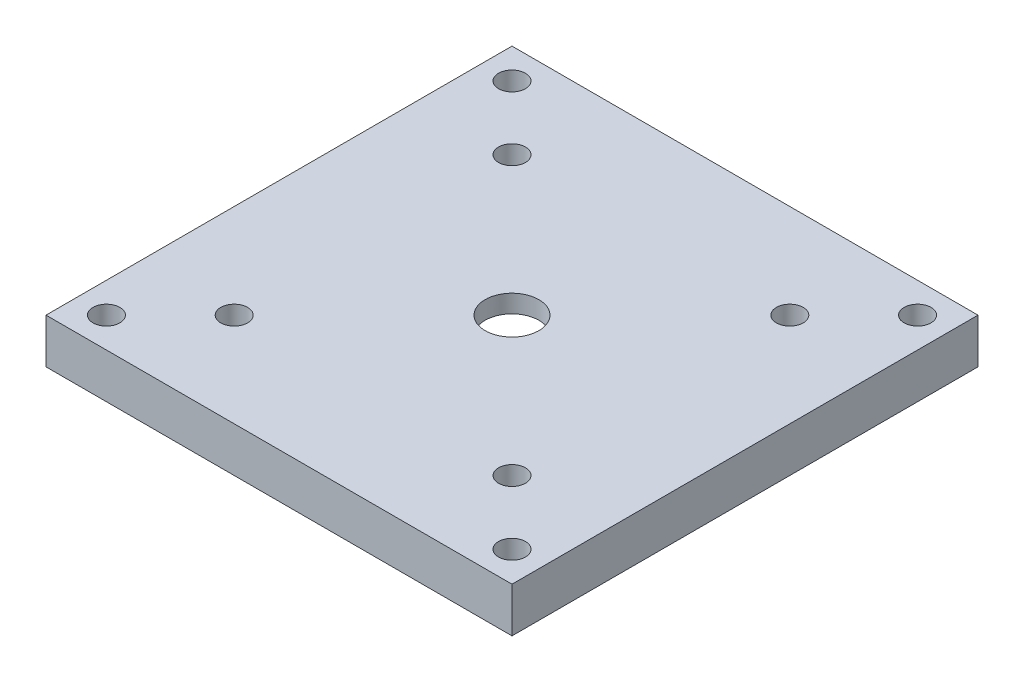
ISO-10303-21;
HEADER;
FILE_DESCRIPTION(('STEP AP214'),'2;1');
FILE_NAME('part.step','',(''),(''),'','','');
FILE_SCHEMA(('AUTOMOTIVE_DESIGN { 1 0 10303 214 1 1 1 1 }'));
ENDSEC;
DATA;
#1=APPLICATION_CONTEXT('core data for automotive mechanical design processes');
#2=APPLICATION_PROTOCOL_DEFINITION('international standard','automotive_design',2000,#1);
#3=PRODUCT_CONTEXT('',#1,'mechanical');
#4=PRODUCT('Part','Part','',(#3));
#5=PRODUCT_RELATED_PRODUCT_CATEGORY('part','',(#4));
#6=PRODUCT_DEFINITION_FORMATION('','',#4);
#7=PRODUCT_DEFINITION_CONTEXT('part definition',#1,'design');
#8=PRODUCT_DEFINITION('design','',#6,#7);
#9=PRODUCT_DEFINITION_SHAPE('','',#8);
#10=(LENGTH_UNIT() NAMED_UNIT(*) SI_UNIT(.MILLI.,.METRE.));
#11=(NAMED_UNIT(*) PLANE_ANGLE_UNIT() SI_UNIT($,.RADIAN.));
#12=(NAMED_UNIT(*) SI_UNIT($,.STERADIAN.) SOLID_ANGLE_UNIT());
#13=UNCERTAINTY_MEASURE_WITH_UNIT(LENGTH_MEASURE(1.E-05),#10,'distance_accuracy_value','');
#14=(GEOMETRIC_REPRESENTATION_CONTEXT(3) GLOBAL_UNCERTAINTY_ASSIGNED_CONTEXT((#13)) GLOBAL_UNIT_ASSIGNED_CONTEXT((#10,
#11,#12)) REPRESENTATION_CONTEXT('',''));
#15=CARTESIAN_POINT('',(0.,0.,0.));
#16=DIRECTION('',(0.,0.,1.));
#17=DIRECTION('',(1.,0.,0.));
#18=AXIS2_PLACEMENT_3D('',#15,#16,#17);
#19=CARTESIAN_POINT('',(0.,5.,0.));
#20=DIRECTION('',(0.,-1.,0.));
#21=DIRECTION('',(0.,0.,-1.));
#22=AXIS2_PLACEMENT_3D('',#19,#20,#21);
#23=PLANE('',#22);
#24=CARTESIAN_POINT('',(15.5,5.,-15.5));
#25=DIRECTION('',(0.,-1.,0.));
#26=DIRECTION('',(0.,0.,-1.));
#27=AXIS2_PLACEMENT_3D('',#24,#25,#26);
#28=CIRCLE('',#27,1.5);
#29=CARTESIAN_POINT('',(15.5,5.,-17.));
#30=VERTEX_POINT('',#29);
#31=EDGE_CURVE('E234',#30,#30,#28,.F.);
#32=ORIENTED_EDGE('',*,*,#31,.F.);
#33=EDGE_LOOP('',(#32));
#34=FACE_BOUND('',#33,.T.);
#35=CARTESIAN_POINT('',(-15.5,5.,15.5));
#36=DIRECTION('',(0.,-1.,0.));
#37=DIRECTION('',(0.,0.,-1.));
#38=AXIS2_PLACEMENT_3D('',#35,#36,#37);
#39=CIRCLE('',#38,1.49999999999999);
#40=CARTESIAN_POINT('',(-15.5,5.,14.));
#41=VERTEX_POINT('',#40);
#42=EDGE_CURVE('E235',#41,#41,#39,.F.);
#43=ORIENTED_EDGE('',*,*,#42,.F.);
#44=EDGE_LOOP('',(#43));
#45=FACE_BOUND('',#44,.T.);
#46=CARTESIAN_POINT('',(0.,5.,0.));
#47=DIRECTION('',(0.,-1.,0.));
#48=DIRECTION('',(0.,0.,-1.));
#49=AXIS2_PLACEMENT_3D('',#46,#47,#48);
#50=CIRCLE('',#49,3.);
#51=CARTESIAN_POINT('',(0.,5.,-3.));
#52=VERTEX_POINT('',#51);
#53=EDGE_CURVE('E238',#52,#52,#50,.F.);
#54=ORIENTED_EDGE('',*,*,#53,.F.);
#55=EDGE_LOOP('',(#54));
#56=FACE_BOUND('',#55,.T.);
#57=CARTESIAN_POINT('',(-15.5,5.,-15.5));
#58=DIRECTION('',(0.,-1.,0.));
#59=DIRECTION('',(0.,0.,-1.));
#60=AXIS2_PLACEMENT_3D('',#57,#58,#59);
#61=CIRCLE('',#60,1.49999999999999);
#62=CARTESIAN_POINT('',(-15.5,5.,-17.));
#63=VERTEX_POINT('',#62);
#64=EDGE_CURVE('E108',#63,#63,#61,.T.);
#65=ORIENTED_EDGE('',*,*,#64,.T.);
#66=EDGE_LOOP('',(#65));
#67=FACE_BOUND('',#66,.T.);
#68=CARTESIAN_POINT('',(-22.6274169979695,5.,-22.6274169979695));
#69=DIRECTION('',(0.,-1.,0.));
#70=DIRECTION('',(0.,0.,-1.));
#71=AXIS2_PLACEMENT_3D('',#68,#69,#70);
#72=CIRCLE('',#71,1.5);
#73=CARTESIAN_POINT('',(-22.6274169979695,5.,-24.1274169979695));
#74=VERTEX_POINT('',#73);
#75=EDGE_CURVE('E149',#74,#74,#72,.T.);
#76=ORIENTED_EDGE('',*,*,#75,.T.);
#77=EDGE_LOOP('',(#76));
#78=FACE_BOUND('',#77,.T.);
#79=CARTESIAN_POINT('',(22.6274169979695,5.,22.6274169979695));
#80=DIRECTION('',(0.,-1.,0.));
#81=DIRECTION('',(0.,0.,-1.));
#82=AXIS2_PLACEMENT_3D('',#79,#80,#81);
#83=CIRCLE('',#82,1.5);
#84=CARTESIAN_POINT('',(22.6274169979695,5.,21.1274169979695));
#85=VERTEX_POINT('',#84);
#86=EDGE_CURVE('E143',#85,#85,#83,.T.);
#87=ORIENTED_EDGE('',*,*,#86,.T.);
#88=EDGE_LOOP('',(#87));
#89=FACE_BOUND('',#88,.T.);
#90=CARTESIAN_POINT('',(15.5,5.,15.5));
#91=DIRECTION('',(0.,-1.,0.));
#92=DIRECTION('',(0.,0.,-1.));
#93=AXIS2_PLACEMENT_3D('',#90,#91,#92);
#94=CIRCLE('',#93,1.5);
#95=CARTESIAN_POINT('',(15.5,5.,14.));
#96=VERTEX_POINT('',#95);
#97=EDGE_CURVE('E140',#96,#96,#94,.T.);
#98=ORIENTED_EDGE('',*,*,#97,.T.);
#99=EDGE_LOOP('',(#98));
#100=FACE_BOUND('',#99,.T.);
#101=DIRECTION('',(0.,0.,1.));
#102=VECTOR('',#101,1.);
#103=CARTESIAN_POINT('',(26.,5.,-26.));
#104=LINE('',#103,#102);
#105=CARTESIAN_POINT('',(26.,5.,-26.));
#106=VERTEX_POINT('',#105);
#107=CARTESIAN_POINT('',(26.,5.,26.));
#108=VERTEX_POINT('',#107);
#109=EDGE_CURVE('E98',#106,#108,#104,.T.);
#110=ORIENTED_EDGE('',*,*,#109,.F.);
#111=DIRECTION('',(-1.,0.,0.));
#112=VECTOR('',#111,1.);
#113=CARTESIAN_POINT('',(26.,5.,-26.));
#114=LINE('',#113,#112);
#115=CARTESIAN_POINT('',(-26.,5.,-26.));
#116=VERTEX_POINT('',#115);
#117=EDGE_CURVE('E87',#106,#116,#114,.T.);
#118=ORIENTED_EDGE('',*,*,#117,.T.);
#119=DIRECTION('',(0.,0.,1.));
#120=VECTOR('',#119,1.);
#121=CARTESIAN_POINT('',(-26.,5.,-26.));
#122=LINE('',#121,#120);
#123=CARTESIAN_POINT('',(-26.,5.,26.));
#124=VERTEX_POINT('',#123);
#125=EDGE_CURVE('E82',#116,#124,#122,.T.);
#126=ORIENTED_EDGE('',*,*,#125,.T.);
#127=DIRECTION('',(-1.,0.,0.));
#128=VECTOR('',#127,1.);
#129=CARTESIAN_POINT('',(26.,5.,26.));
#130=LINE('',#129,#128);
#131=EDGE_CURVE('E86',#108,#124,#130,.T.);
#132=ORIENTED_EDGE('',*,*,#131,.F.);
#133=EDGE_LOOP('',(#110,#118,#126,#132));
#134=FACE_BOUND('',#133,.T.);
#135=CARTESIAN_POINT('',(22.6274169979695,5.,-22.6274169979695));
#136=DIRECTION('',(0.,-1.,0.));
#137=DIRECTION('',(0.,0.,-1.));
#138=AXIS2_PLACEMENT_3D('',#135,#136,#137);
#139=CIRCLE('',#138,1.5);
#140=CARTESIAN_POINT('',(22.6274169979695,5.,-24.1274169979695));
#141=VERTEX_POINT('',#140);
#142=EDGE_CURVE('E146',#141,#141,#139,.F.);
#143=ORIENTED_EDGE('',*,*,#142,.F.);
#144=EDGE_LOOP('',(#143));
#145=FACE_BOUND('',#144,.T.);
#146=CARTESIAN_POINT('',(-22.6274169979695,5.,22.6274169979695));
#147=DIRECTION('',(0.,-1.,0.));
#148=DIRECTION('',(0.,0.,-1.));
#149=AXIS2_PLACEMENT_3D('',#146,#147,#148);
#150=CIRCLE('',#149,1.5);
#151=CARTESIAN_POINT('',(-22.6274169979695,5.,21.1274169979695));
#152=VERTEX_POINT('',#151);
#153=EDGE_CURVE('E152',#152,#152,#150,.F.);
#154=ORIENTED_EDGE('',*,*,#153,.F.);
#155=EDGE_LOOP('',(#154));
#156=FACE_BOUND('',#155,.T.);
#157=ADVANCED_FACE('F35',(#34,#45,#56,#67,#78,#89,#100,#134,#145,#156),#23,.F.);
#158=CARTESIAN_POINT('',(0.,0.,0.));
#159=DIRECTION('',(0.,-1.,0.));
#160=DIRECTION('',(0.,0.,-1.));
#161=AXIS2_PLACEMENT_3D('',#158,#159,#160);
#162=PLANE('',#161);
#163=CARTESIAN_POINT('',(15.5,0.,-15.5));
#164=DIRECTION('',(0.,1.,0.));
#165=DIRECTION('',(0.,0.,1.));
#166=AXIS2_PLACEMENT_3D('',#163,#164,#165);
#167=CIRCLE('',#166,1.5);
#168=CARTESIAN_POINT('',(15.5,0.,-14.));
#169=VERTEX_POINT('',#168);
#170=EDGE_CURVE('E232',#169,#169,#167,.T.);
#171=ORIENTED_EDGE('',*,*,#170,.T.);
#172=EDGE_LOOP('',(#171));
#173=FACE_BOUND('',#172,.T.);
#174=CARTESIAN_POINT('',(-15.5,0.,15.5));
#175=DIRECTION('',(0.,1.,0.));
#176=DIRECTION('',(0.,0.,1.));
#177=AXIS2_PLACEMENT_3D('',#174,#175,#176);
#178=CIRCLE('',#177,1.49999999999999);
#179=CARTESIAN_POINT('',(-15.5,0.,17.));
#180=VERTEX_POINT('',#179);
#181=EDGE_CURVE('E269',#180,#180,#178,.T.);
#182=ORIENTED_EDGE('',*,*,#181,.T.);
#183=EDGE_LOOP('',(#182));
#184=FACE_BOUND('',#183,.T.);
#185=CARTESIAN_POINT('',(0.,0.,0.));
#186=DIRECTION('',(0.,1.,0.));
#187=DIRECTION('',(0.,0.,1.));
#188=AXIS2_PLACEMENT_3D('',#185,#186,#187);
#189=CIRCLE('',#188,10.);
#190=CARTESIAN_POINT('',(0.,0.,10.));
#191=VERTEX_POINT('',#190);
#192=EDGE_CURVE('E245',#191,#191,#189,.T.);
#193=ORIENTED_EDGE('',*,*,#192,.T.);
#194=EDGE_LOOP('',(#193));
#195=FACE_BOUND('',#194,.T.);
#196=CARTESIAN_POINT('',(-15.5,0.,-15.5));
#197=DIRECTION('',(0.,-1.,0.));
#198=DIRECTION('',(0.,0.,-1.));
#199=AXIS2_PLACEMENT_3D('',#196,#197,#198);
#200=CIRCLE('',#199,1.49999999999999);
#201=CARTESIAN_POINT('',(-15.5,0.,-17.));
#202=VERTEX_POINT('',#201);
#203=EDGE_CURVE('E126',#202,#202,#200,.T.);
#204=ORIENTED_EDGE('',*,*,#203,.F.);
#205=EDGE_LOOP('',(#204));
#206=FACE_BOUND('',#205,.T.);
#207=CARTESIAN_POINT('',(22.6274169979695,0.,-22.6274169979695));
#208=DIRECTION('',(0.,1.,0.));
#209=DIRECTION('',(0.,0.,1.));
#210=AXIS2_PLACEMENT_3D('',#207,#208,#209);
#211=CIRCLE('',#210,1.5);
#212=CARTESIAN_POINT('',(22.6274169979695,0.,-21.1274169979695));
#213=VERTEX_POINT('',#212);
#214=EDGE_CURVE('E131',#213,#213,#211,.T.);
#215=ORIENTED_EDGE('',*,*,#214,.T.);
#216=EDGE_LOOP('',(#215));
#217=FACE_BOUND('',#216,.T.);
#218=CARTESIAN_POINT('',(22.6274169979695,0.,22.6274169979695));
#219=DIRECTION('',(0.,-1.,0.));
#220=DIRECTION('',(0.,0.,-1.));
#221=AXIS2_PLACEMENT_3D('',#218,#219,#220);
#222=CIRCLE('',#221,1.5);
#223=CARTESIAN_POINT('',(22.6274169979695,0.,21.1274169979695));
#224=VERTEX_POINT('',#223);
#225=EDGE_CURVE('E137',#224,#224,#222,.T.);
#226=ORIENTED_EDGE('',*,*,#225,.F.);
#227=EDGE_LOOP('',(#226));
#228=FACE_BOUND('',#227,.T.);
#229=CARTESIAN_POINT('',(15.5,0.,15.5));
#230=DIRECTION('',(0.,-1.,0.));
#231=DIRECTION('',(0.,0.,-1.));
#232=AXIS2_PLACEMENT_3D('',#229,#230,#231);
#233=CIRCLE('',#232,1.5);
#234=CARTESIAN_POINT('',(15.5,0.,14.));
#235=VERTEX_POINT('',#234);
#236=EDGE_CURVE('E129',#235,#235,#233,.T.);
#237=ORIENTED_EDGE('',*,*,#236,.F.);
#238=EDGE_LOOP('',(#237));
#239=FACE_BOUND('',#238,.T.);
#240=DIRECTION('',(0.,0.,1.));
#241=VECTOR('',#240,1.);
#242=CARTESIAN_POINT('',(26.,0.,-26.));
#243=LINE('',#242,#241);
#244=CARTESIAN_POINT('',(26.,0.,-26.));
#245=VERTEX_POINT('',#244);
#246=CARTESIAN_POINT('',(26.,0.,26.));
#247=VERTEX_POINT('',#246);
#248=EDGE_CURVE('E104',#245,#247,#243,.T.);
#249=ORIENTED_EDGE('',*,*,#248,.T.);
#250=DIRECTION('',(-1.,0.,0.));
#251=VECTOR('',#250,1.);
#252=CARTESIAN_POINT('',(26.,0.,26.));
#253=LINE('',#252,#251);
#254=CARTESIAN_POINT('',(-26.,0.,26.));
#255=VERTEX_POINT('',#254);
#256=EDGE_CURVE('E107',#247,#255,#253,.T.);
#257=ORIENTED_EDGE('',*,*,#256,.T.);
#258=DIRECTION('',(0.,0.,1.));
#259=VECTOR('',#258,1.);
#260=CARTESIAN_POINT('',(-26.,0.,-26.));
#261=LINE('',#260,#259);
#262=CARTESIAN_POINT('',(-26.,0.,-26.));
#263=VERTEX_POINT('',#262);
#264=EDGE_CURVE('E94',#263,#255,#261,.T.);
#265=ORIENTED_EDGE('',*,*,#264,.F.);
#266=DIRECTION('',(-1.,0.,0.));
#267=VECTOR('',#266,1.);
#268=CARTESIAN_POINT('',(26.,0.,-26.));
#269=LINE('',#268,#267);
#270=EDGE_CURVE('E69',#245,#263,#269,.T.);
#271=ORIENTED_EDGE('',*,*,#270,.F.);
#272=EDGE_LOOP('',(#249,#257,#265,#271));
#273=FACE_BOUND('',#272,.T.);
#274=CARTESIAN_POINT('',(-22.6274169979695,0.,-22.6274169979695));
#275=DIRECTION('',(0.,-1.,0.));
#276=DIRECTION('',(0.,0.,-1.));
#277=AXIS2_PLACEMENT_3D('',#274,#275,#276);
#278=CIRCLE('',#277,1.5);
#279=CARTESIAN_POINT('',(-22.6274169979695,0.,-24.1274169979695));
#280=VERTEX_POINT('',#279);
#281=EDGE_CURVE('E121',#280,#280,#278,.T.);
#282=ORIENTED_EDGE('',*,*,#281,.F.);
#283=EDGE_LOOP('',(#282));
#284=FACE_BOUND('',#283,.T.);
#285=CARTESIAN_POINT('',(-22.6274169979695,0.,22.6274169979695));
#286=DIRECTION('',(0.,1.,0.));
#287=DIRECTION('',(0.,0.,1.));
#288=AXIS2_PLACEMENT_3D('',#285,#286,#287);
#289=CIRCLE('',#288,1.5);
#290=CARTESIAN_POINT('',(-22.6274169979695,0.,24.1274169979695));
#291=VERTEX_POINT('',#290);
#292=EDGE_CURVE('E124',#291,#291,#289,.T.);
#293=ORIENTED_EDGE('',*,*,#292,.T.);
#294=EDGE_LOOP('',(#293));
#295=FACE_BOUND('',#294,.T.);
#296=ADVANCED_FACE('F113',(#173,#184,#195,#206,#217,#228,#239,#273,#284,#295),#162,.T.);
#297=CARTESIAN_POINT('',(26.,5.,-26.));
#298=DIRECTION('',(1.,0.,0.));
#299=DIRECTION('',(0.,0.,-1.));
#300=AXIS2_PLACEMENT_3D('',#297,#298,#299);
#301=PLANE('',#300);
#302=ORIENTED_EDGE('',*,*,#248,.F.);
#303=DIRECTION('',(0.,-1.,0.));
#304=VECTOR('',#303,1.);
#305=CARTESIAN_POINT('',(26.,5.,-26.));
#306=LINE('',#305,#304);
#307=EDGE_CURVE('E11',#106,#245,#306,.T.);
#308=ORIENTED_EDGE('',*,*,#307,.F.);
#309=ORIENTED_EDGE('',*,*,#109,.T.);
#310=DIRECTION('',(0.,-1.,0.));
#311=VECTOR('',#310,1.);
#312=CARTESIAN_POINT('',(26.,5.,26.));
#313=LINE('',#312,#311);
#314=EDGE_CURVE('E77',#108,#247,#313,.T.);
#315=ORIENTED_EDGE('',*,*,#314,.T.);
#316=EDGE_LOOP('',(#302,#308,#309,#315));
#317=FACE_BOUND('',#316,.T.);
#318=ADVANCED_FACE('F37',(#317),#301,.T.);
#319=CARTESIAN_POINT('',(26.,5.,-26.));
#320=DIRECTION('',(0.,0.,1.));
#321=DIRECTION('',(1.,0.,0.));
#322=AXIS2_PLACEMENT_3D('',#319,#320,#321);
#323=PLANE('',#322);
#324=ORIENTED_EDGE('',*,*,#270,.T.);
#325=DIRECTION('',(0.,-1.,0.));
#326=VECTOR('',#325,1.);
#327=CARTESIAN_POINT('',(-26.,5.,-26.));
#328=LINE('',#327,#326);
#329=EDGE_CURVE('E45',#116,#263,#328,.T.);
#330=ORIENTED_EDGE('',*,*,#329,.F.);
#331=ORIENTED_EDGE('',*,*,#117,.F.);
#332=ORIENTED_EDGE('',*,*,#307,.T.);
#333=EDGE_LOOP('',(#324,#330,#331,#332));
#334=FACE_BOUND('',#333,.T.);
#335=ADVANCED_FACE('F186',(#334),#323,.F.);
#336=CARTESIAN_POINT('',(-26.,5.,-26.));
#337=DIRECTION('',(1.,0.,0.));
#338=DIRECTION('',(0.,0.,-1.));
#339=AXIS2_PLACEMENT_3D('',#336,#337,#338);
#340=PLANE('',#339);
#341=ORIENTED_EDGE('',*,*,#264,.T.);
#342=DIRECTION('',(0.,-1.,0.));
#343=VECTOR('',#342,1.);
#344=CARTESIAN_POINT('',(-26.,5.,26.));
#345=LINE('',#344,#343);
#346=EDGE_CURVE('E91',#124,#255,#345,.T.);
#347=ORIENTED_EDGE('',*,*,#346,.F.);
#348=ORIENTED_EDGE('',*,*,#125,.F.);
#349=ORIENTED_EDGE('',*,*,#329,.T.);
#350=EDGE_LOOP('',(#341,#347,#348,#349));
#351=FACE_BOUND('',#350,.T.);
#352=ADVANCED_FACE('F92',(#351),#340,.F.);
#353=CARTESIAN_POINT('',(26.,5.,26.));
#354=DIRECTION('',(0.,0.,1.));
#355=DIRECTION('',(1.,0.,0.));
#356=AXIS2_PLACEMENT_3D('',#353,#354,#355);
#357=PLANE('',#356);
#358=ORIENTED_EDGE('',*,*,#256,.F.);
#359=ORIENTED_EDGE('',*,*,#314,.F.);
#360=ORIENTED_EDGE('',*,*,#131,.T.);
#361=ORIENTED_EDGE('',*,*,#346,.T.);
#362=EDGE_LOOP('',(#358,#359,#360,#361));
#363=FACE_BOUND('',#362,.T.);
#364=ADVANCED_FACE('F97',(#363),#357,.T.);
#365=CARTESIAN_POINT('',(15.5,13.,15.5));
#366=DIRECTION('',(0.,-1.,0.));
#367=DIRECTION('',(0.,0.,-1.));
#368=AXIS2_PLACEMENT_3D('',#365,#366,#367);
#369=CYLINDRICAL_SURFACE('',#368,1.5);
#370=ORIENTED_EDGE('',*,*,#236,.T.);
#371=EDGE_LOOP('',(#370));
#372=FACE_BOUND('',#371,.T.);
#373=ORIENTED_EDGE('',*,*,#97,.F.);
#374=EDGE_LOOP('',(#373));
#375=FACE_BOUND('',#374,.T.);
#376=ADVANCED_FACE('F183',(#372,#375),#369,.F.);
#377=CARTESIAN_POINT('',(22.6274169979695,13.,22.6274169979695));
#378=DIRECTION('',(0.,-1.,0.));
#379=DIRECTION('',(0.,0.,-1.));
#380=AXIS2_PLACEMENT_3D('',#377,#378,#379);
#381=CYLINDRICAL_SURFACE('',#380,1.5);
#382=ORIENTED_EDGE('',*,*,#225,.T.);
#383=EDGE_LOOP('',(#382));
#384=FACE_BOUND('',#383,.T.);
#385=ORIENTED_EDGE('',*,*,#86,.F.);
#386=EDGE_LOOP('',(#385));
#387=FACE_BOUND('',#386,.T.);
#388=ADVANCED_FACE('F194',(#384,#387),#381,.F.);
#389=CARTESIAN_POINT('',(22.6274169979695,13.,-22.6274169979695));
#390=DIRECTION('',(0.,-1.,0.));
#391=DIRECTION('',(0.,0.,-1.));
#392=AXIS2_PLACEMENT_3D('',#389,#390,#391);
#393=CYLINDRICAL_SURFACE('',#392,1.5);
#394=ORIENTED_EDGE('',*,*,#214,.F.);
#395=EDGE_LOOP('',(#394));
#396=FACE_BOUND('',#395,.T.);
#397=ORIENTED_EDGE('',*,*,#142,.T.);
#398=EDGE_LOOP('',(#397));
#399=FACE_BOUND('',#398,.T.);
#400=ADVANCED_FACE('F199',(#396,#399),#393,.F.);
#401=CARTESIAN_POINT('',(-22.6274169979695,13.,-22.6274169979695));
#402=DIRECTION('',(0.,-1.,0.));
#403=DIRECTION('',(0.,0.,-1.));
#404=AXIS2_PLACEMENT_3D('',#401,#402,#403);
#405=CYLINDRICAL_SURFACE('',#404,1.5);
#406=ORIENTED_EDGE('',*,*,#281,.T.);
#407=EDGE_LOOP('',(#406));
#408=FACE_BOUND('',#407,.T.);
#409=ORIENTED_EDGE('',*,*,#75,.F.);
#410=EDGE_LOOP('',(#409));
#411=FACE_BOUND('',#410,.T.);
#412=ADVANCED_FACE('F172',(#408,#411),#405,.F.);
#413=CARTESIAN_POINT('',(-22.6274169979695,13.,22.6274169979695));
#414=DIRECTION('',(0.,-1.,0.));
#415=DIRECTION('',(0.,0.,-1.));
#416=AXIS2_PLACEMENT_3D('',#413,#414,#415);
#417=CYLINDRICAL_SURFACE('',#416,1.5);
#418=ORIENTED_EDGE('',*,*,#292,.F.);
#419=EDGE_LOOP('',(#418));
#420=FACE_BOUND('',#419,.T.);
#421=ORIENTED_EDGE('',*,*,#153,.T.);
#422=EDGE_LOOP('',(#421));
#423=FACE_BOUND('',#422,.T.);
#424=ADVANCED_FACE('F162',(#420,#423),#417,.F.);
#425=CARTESIAN_POINT('',(-15.5,13.,-15.5));
#426=DIRECTION('',(0.,-1.,0.));
#427=DIRECTION('',(0.,0.,-1.));
#428=AXIS2_PLACEMENT_3D('',#425,#426,#427);
#429=CYLINDRICAL_SURFACE('',#428,1.49999999999999);
#430=ORIENTED_EDGE('',*,*,#203,.T.);
#431=EDGE_LOOP('',(#430));
#432=FACE_BOUND('',#431,.T.);
#433=ORIENTED_EDGE('',*,*,#64,.F.);
#434=EDGE_LOOP('',(#433));
#435=FACE_BOUND('',#434,.T.);
#436=ADVANCED_FACE('F159',(#432,#435),#429,.F.);
#437=CARTESIAN_POINT('',(0.,3.,0.));
#438=DIRECTION('',(0.,-1.,0.));
#439=DIRECTION('',(0.,0.,-1.));
#440=AXIS2_PLACEMENT_3D('',#437,#438,#439);
#441=CYLINDRICAL_SURFACE('',#440,10.);
#442=CARTESIAN_POINT('',(0.,3.,0.));
#443=DIRECTION('',(0.,1.,0.));
#444=DIRECTION('',(0.,0.,1.));
#445=AXIS2_PLACEMENT_3D('',#442,#443,#444);
#446=CIRCLE('',#445,10.);
#447=CARTESIAN_POINT('',(0.,3.,10.));
#448=VERTEX_POINT('',#447);
#449=EDGE_CURVE('E246',#448,#448,#446,.T.);
#450=ORIENTED_EDGE('',*,*,#449,.T.);
#451=EDGE_LOOP('',(#450));
#452=FACE_BOUND('',#451,.T.);
#453=ORIENTED_EDGE('',*,*,#192,.F.);
#454=EDGE_LOOP('',(#453));
#455=FACE_BOUND('',#454,.T.);
#456=ADVANCED_FACE('F161',(#452,#455),#441,.F.);
#457=CARTESIAN_POINT('',(0.,3.,0.));
#458=DIRECTION('',(0.,1.,0.));
#459=DIRECTION('',(0.,0.,1.));
#460=AXIS2_PLACEMENT_3D('',#457,#458,#459);
#461=PLANE('',#460);
#462=CARTESIAN_POINT('',(0.,3.,0.));
#463=DIRECTION('',(0.,1.,0.));
#464=DIRECTION('',(0.,0.,1.));
#465=AXIS2_PLACEMENT_3D('',#462,#463,#464);
#466=CIRCLE('',#465,3.);
#467=CARTESIAN_POINT('',(0.,3.,3.));
#468=VERTEX_POINT('',#467);
#469=EDGE_CURVE('E39',#468,#468,#466,.F.);
#470=ORIENTED_EDGE('',*,*,#469,.F.);
#471=EDGE_LOOP('',(#470));
#472=FACE_BOUND('',#471,.T.);
#473=ORIENTED_EDGE('',*,*,#449,.F.);
#474=EDGE_LOOP('',(#473));
#475=FACE_BOUND('',#474,.T.);
#476=ADVANCED_FACE('F169',(#472,#475),#461,.F.);
#477=CARTESIAN_POINT('',(0.,24.,0.));
#478=DIRECTION('',(0.,-1.,0.));
#479=DIRECTION('',(0.,0.,-1.));
#480=AXIS2_PLACEMENT_3D('',#477,#478,#479);
#481=CYLINDRICAL_SURFACE('',#480,3.);
#482=ORIENTED_EDGE('',*,*,#469,.T.);
#483=EDGE_LOOP('',(#482));
#484=FACE_BOUND('',#483,.T.);
#485=ORIENTED_EDGE('',*,*,#53,.T.);
#486=EDGE_LOOP('',(#485));
#487=FACE_BOUND('',#486,.T.);
#488=ADVANCED_FACE('F215',(#484,#487),#481,.F.);
#489=CARTESIAN_POINT('',(-15.5,24.,15.5));
#490=DIRECTION('',(0.,-1.,0.));
#491=DIRECTION('',(0.,0.,-1.));
#492=AXIS2_PLACEMENT_3D('',#489,#490,#491);
#493=CYLINDRICAL_SURFACE('',#492,1.49999999999999);
#494=ORIENTED_EDGE('',*,*,#181,.F.);
#495=EDGE_LOOP('',(#494));
#496=FACE_BOUND('',#495,.T.);
#497=ORIENTED_EDGE('',*,*,#42,.T.);
#498=EDGE_LOOP('',(#497));
#499=FACE_BOUND('',#498,.T.);
#500=ADVANCED_FACE('F219',(#496,#499),#493,.F.);
#501=CARTESIAN_POINT('',(15.5,24.,-15.5));
#502=DIRECTION('',(0.,-1.,0.));
#503=DIRECTION('',(0.,0.,-1.));
#504=AXIS2_PLACEMENT_3D('',#501,#502,#503);
#505=CYLINDRICAL_SURFACE('',#504,1.5);
#506=ORIENTED_EDGE('',*,*,#170,.F.);
#507=EDGE_LOOP('',(#506));
#508=FACE_BOUND('',#507,.T.);
#509=ORIENTED_EDGE('',*,*,#31,.T.);
#510=EDGE_LOOP('',(#509));
#511=FACE_BOUND('',#510,.T.);
#512=ADVANCED_FACE('F223',(#508,#511),#505,.F.);
#513=CLOSED_SHELL('',(#157,#296,#318,#335,#352,#364,#376,#388,#400,#412,#424,#436,#456,#476,
#488,#500,#512));
#514=MANIFOLD_SOLID_BREP('B2',#513);
#515=ADVANCED_BREP_SHAPE_REPRESENTATION('',(#18,#514),#14);
#516=SHAPE_DEFINITION_REPRESENTATION(#9,#515);
ENDSEC;
END-ISO-10303-21;
